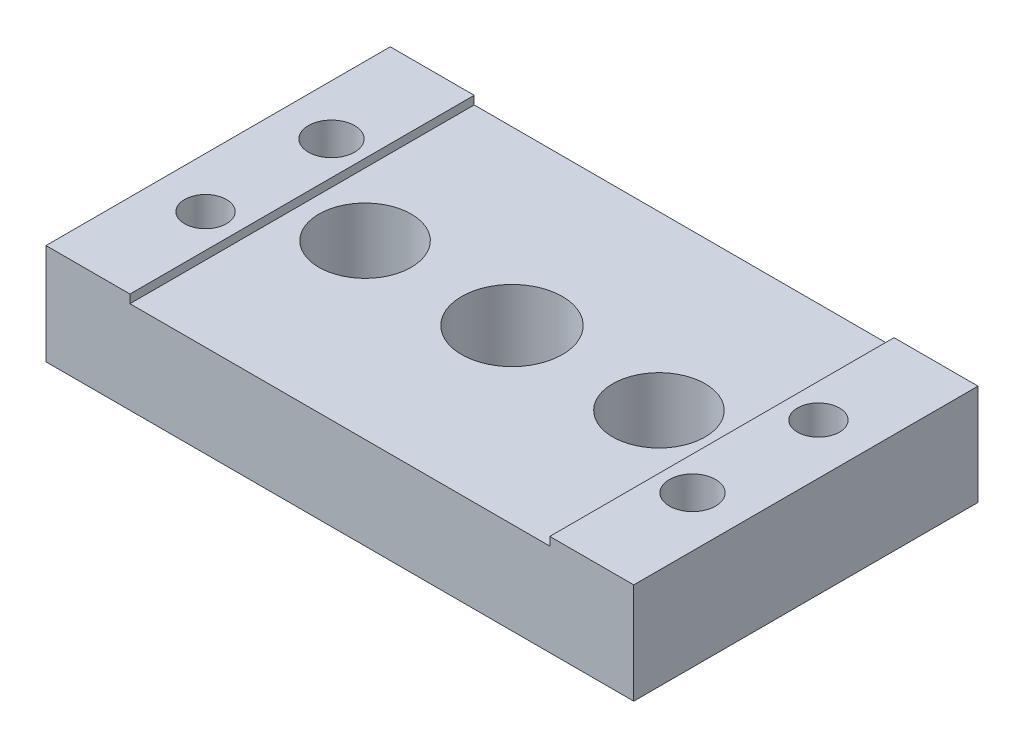
ISO-10303-21;
HEADER;
FILE_DESCRIPTION(('STEP AP214'),'2;1');
FILE_NAME('part.step','',(''),(''),'','','');
FILE_SCHEMA(('AUTOMOTIVE_DESIGN { 1 0 10303 214 1 1 1 1 }'));
ENDSEC;
DATA;
#1=APPLICATION_CONTEXT('core data for automotive mechanical design processes');
#2=APPLICATION_PROTOCOL_DEFINITION('international standard','automotive_design',2000,#1);
#3=PRODUCT_CONTEXT('',#1,'mechanical');
#4=PRODUCT('Part','Part','',(#3));
#5=PRODUCT_RELATED_PRODUCT_CATEGORY('part','',(#4));
#6=PRODUCT_DEFINITION_FORMATION('','',#4);
#7=PRODUCT_DEFINITION_CONTEXT('part definition',#1,'design');
#8=PRODUCT_DEFINITION('design','',#6,#7);
#9=PRODUCT_DEFINITION_SHAPE('','',#8);
#10=(LENGTH_UNIT() NAMED_UNIT(*) SI_UNIT(.MILLI.,.METRE.));
#11=(NAMED_UNIT(*) PLANE_ANGLE_UNIT() SI_UNIT($,.RADIAN.));
#12=(NAMED_UNIT(*) SI_UNIT($,.STERADIAN.) SOLID_ANGLE_UNIT());
#13=UNCERTAINTY_MEASURE_WITH_UNIT(LENGTH_MEASURE(1.E-05),#10,'distance_accuracy_value','');
#14=(GEOMETRIC_REPRESENTATION_CONTEXT(3) GLOBAL_UNCERTAINTY_ASSIGNED_CONTEXT((#13)) GLOBAL_UNIT_ASSIGNED_CONTEXT((#10,
#11,#12)) REPRESENTATION_CONTEXT('',''));
#15=CARTESIAN_POINT('',(0.,0.,0.));
#16=DIRECTION('',(0.,0.,1.));
#17=DIRECTION('',(1.,0.,0.));
#18=AXIS2_PLACEMENT_3D('',#15,#16,#17);
#19=CARTESIAN_POINT('',(29.,88.,7.50000000000001));
#20=DIRECTION('',(0.,-1.,0.));
#21=DIRECTION('',(0.,0.,-1.));
#22=AXIS2_PLACEMENT_3D('',#19,#20,#21);
#23=CYLINDRICAL_SURFACE('',#22,2.75);
#24=CARTESIAN_POINT('',(29.,12.,7.50000000000001));
#25=DIRECTION('',(0.,1.,0.));
#26=DIRECTION('',(0.,0.,1.));
#27=AXIS2_PLACEMENT_3D('',#24,#25,#26);
#28=CIRCLE('',#27,2.75);
#29=CARTESIAN_POINT('',(29.,12.,10.25));
#30=VERTEX_POINT('',#29);
#31=EDGE_CURVE('E207',#30,#30,#28,.T.);
#32=ORIENTED_EDGE('',*,*,#31,.T.);
#33=EDGE_LOOP('',(#32));
#34=FACE_BOUND('',#33,.T.);
#35=CARTESIAN_POINT('',(29.,5.7,7.50000000000001));
#36=DIRECTION('',(0.,-1.,0.));
#37=DIRECTION('',(0.,0.,-1.));
#38=AXIS2_PLACEMENT_3D('',#35,#36,#37);
#39=CIRCLE('',#38,2.75);
#40=CARTESIAN_POINT('',(29.,5.7,4.75));
#41=VERTEX_POINT('',#40);
#42=EDGE_CURVE('E170',#41,#41,#39,.F.);
#43=ORIENTED_EDGE('',*,*,#42,.F.);
#44=EDGE_LOOP('',(#43));
#45=FACE_BOUND('',#44,.T.);
#46=ADVANCED_FACE('F33',(#34,#45),#23,.F.);
#47=CARTESIAN_POINT('',(-29.,88.,-7.5));
#48=DIRECTION('',(0.,-1.,0.));
#49=DIRECTION('',(0.,0.,-1.));
#50=AXIS2_PLACEMENT_3D('',#47,#48,#49);
#51=CYLINDRICAL_SURFACE('',#50,2.75);
#52=CARTESIAN_POINT('',(-29.,12.,-7.5));
#53=DIRECTION('',(0.,1.,0.));
#54=DIRECTION('',(0.,0.,1.));
#55=AXIS2_PLACEMENT_3D('',#52,#53,#54);
#56=CIRCLE('',#55,2.75);
#57=CARTESIAN_POINT('',(-29.,12.,-4.75));
#58=VERTEX_POINT('',#57);
#59=EDGE_CURVE('E128',#58,#58,#56,.T.);
#60=ORIENTED_EDGE('',*,*,#59,.T.);
#61=EDGE_LOOP('',(#60));
#62=FACE_BOUND('',#61,.T.);
#63=CARTESIAN_POINT('',(-29.,5.7,-7.5));
#64=DIRECTION('',(0.,-1.,0.));
#65=DIRECTION('',(0.,0.,-1.));
#66=AXIS2_PLACEMENT_3D('',#63,#64,#65);
#67=CIRCLE('',#66,2.75);
#68=CARTESIAN_POINT('',(-29.,5.7,-10.25));
#69=VERTEX_POINT('',#68);
#70=EDGE_CURVE('E167',#69,#69,#67,.F.);
#71=ORIENTED_EDGE('',*,*,#70,.F.);
#72=EDGE_LOOP('',(#71));
#73=FACE_BOUND('',#72,.T.);
#74=ADVANCED_FACE('F212',(#62,#73),#51,.F.);
#75=CARTESIAN_POINT('',(0.,12.,0.));
#76=DIRECTION('',(0.,1.,0.));
#77=DIRECTION('',(0.,0.,1.));
#78=AXIS2_PLACEMENT_3D('',#75,#76,#77);
#79=PLANE('',#78);
#80=ORIENTED_EDGE('',*,*,#59,.F.);
#81=EDGE_LOOP('',(#80));
#82=FACE_BOUND('',#81,.T.);
#83=CARTESIAN_POINT('',(-29.,12.,7.5));
#84=DIRECTION('',(0.,1.,0.));
#85=DIRECTION('',(0.,0.,1.));
#86=AXIS2_PLACEMENT_3D('',#83,#84,#85);
#87=CIRCLE('',#86,2.5);
#88=CARTESIAN_POINT('',(-29.,12.,10.));
#89=VERTEX_POINT('',#88);
#90=EDGE_CURVE('E204',#89,#89,#87,.T.);
#91=ORIENTED_EDGE('',*,*,#90,.F.);
#92=EDGE_LOOP('',(#91));
#93=FACE_BOUND('',#92,.T.);
#94=DIRECTION('',(0.,0.,1.));
#95=VECTOR('',#94,1.);
#96=CARTESIAN_POINT('',(-25.,12.,0.));
#97=LINE('',#96,#95);
#98=CARTESIAN_POINT('',(-25.,12.,-20.5));
#99=VERTEX_POINT('',#98);
#100=CARTESIAN_POINT('',(-25.,12.,20.5));
#101=VERTEX_POINT('',#100);
#102=EDGE_CURVE('E11',#99,#101,#97,.T.);
#103=ORIENTED_EDGE('',*,*,#102,.F.);
#104=DIRECTION('',(-1.,0.,0.));
#105=VECTOR('',#104,1.);
#106=CARTESIAN_POINT('',(-35.,12.,-20.5));
#107=LINE('',#106,#105);
#108=CARTESIAN_POINT('',(-35.,12.,-20.5));
#109=VERTEX_POINT('',#108);
#110=EDGE_CURVE('E144',#99,#109,#107,.T.);
#111=ORIENTED_EDGE('',*,*,#110,.T.);
#112=DIRECTION('',(0.,0.,1.));
#113=VECTOR('',#112,1.);
#114=CARTESIAN_POINT('',(-35.,12.,-20.5));
#115=LINE('',#114,#113);
#116=CARTESIAN_POINT('',(-35.,12.,20.5));
#117=VERTEX_POINT('',#116);
#118=EDGE_CURVE('E146',#109,#117,#115,.T.);
#119=ORIENTED_EDGE('',*,*,#118,.T.);
#120=DIRECTION('',(1.,0.,0.));
#121=VECTOR('',#120,1.);
#122=CARTESIAN_POINT('',(-35.,12.,20.5));
#123=LINE('',#122,#121);
#124=EDGE_CURVE('E148',#117,#101,#123,.T.);
#125=ORIENTED_EDGE('',*,*,#124,.T.);
#126=EDGE_LOOP('',(#103,#111,#119,#125));
#127=FACE_BOUND('',#126,.T.);
#128=ADVANCED_FACE('F215',(#82,#93,#127),#79,.T.);
#129=CARTESIAN_POINT('',(35.,12.,-20.5));
#130=DIRECTION('',(-1.,0.,0.));
#131=DIRECTION('',(0.,0.,1.));
#132=AXIS2_PLACEMENT_3D('',#129,#130,#131);
#133=PLANE('',#132);
#134=DIRECTION('',(0.,0.,-1.));
#135=VECTOR('',#134,1.);
#136=CARTESIAN_POINT('',(35.,0.,-20.5));
#137=LINE('',#136,#135);
#138=CARTESIAN_POINT('',(35.,0.,20.5));
#139=VERTEX_POINT('',#138);
#140=CARTESIAN_POINT('',(35.,0.,-20.5));
#141=VERTEX_POINT('',#140);
#142=EDGE_CURVE('E141',#139,#141,#137,.T.);
#143=ORIENTED_EDGE('',*,*,#142,.T.);
#144=DIRECTION('',(0.,-1.,0.));
#145=VECTOR('',#144,1.);
#146=CARTESIAN_POINT('',(35.,12.,-20.5));
#147=LINE('',#146,#145);
#148=CARTESIAN_POINT('',(35.,12.,-20.5));
#149=VERTEX_POINT('',#148);
#150=EDGE_CURVE('E164',#149,#141,#147,.T.);
#151=ORIENTED_EDGE('',*,*,#150,.F.);
#152=DIRECTION('',(0.,0.,-1.));
#153=VECTOR('',#152,1.);
#154=CARTESIAN_POINT('',(35.,12.,-20.5));
#155=LINE('',#154,#153);
#156=CARTESIAN_POINT('',(35.,12.,20.5));
#157=VERTEX_POINT('',#156);
#158=EDGE_CURVE('E142',#157,#149,#155,.T.);
#159=ORIENTED_EDGE('',*,*,#158,.F.);
#160=DIRECTION('',(0.,-1.,0.));
#161=VECTOR('',#160,1.);
#162=CARTESIAN_POINT('',(35.,12.,20.5));
#163=LINE('',#162,#161);
#164=EDGE_CURVE('E150',#157,#139,#163,.T.);
#165=ORIENTED_EDGE('',*,*,#164,.T.);
#166=EDGE_LOOP('',(#143,#151,#159,#165));
#167=FACE_BOUND('',#166,.T.);
#168=ADVANCED_FACE('F35',(#167),#133,.F.);
#169=CARTESIAN_POINT('',(-35.,12.,-20.5));
#170=DIRECTION('',(0.,0.,1.));
#171=DIRECTION('',(1.,0.,0.));
#172=AXIS2_PLACEMENT_3D('',#169,#170,#171);
#173=PLANE('',#172);
#174=CARTESIAN_POINT('',(6.50000000000001,5.5,-20.5));
#175=DIRECTION('',(0.,0.,-1.));
#176=DIRECTION('',(-1.,0.,0.));
#177=AXIS2_PLACEMENT_3D('',#174,#175,#176);
#178=CIRCLE('',#177,2.5);
#179=CARTESIAN_POINT('',(4.00000000000001,5.5,-20.5));
#180=VERTEX_POINT('',#179);
#181=EDGE_CURVE('E302',#180,#180,#178,.T.);
#182=ORIENTED_EDGE('',*,*,#181,.F.);
#183=EDGE_LOOP('',(#182));
#184=FACE_BOUND('',#183,.T.);
#185=ORIENTED_EDGE('',*,*,#110,.F.);
#186=DIRECTION('',(0.,-1.,0.));
#187=VECTOR('',#186,1.);
#188=CARTESIAN_POINT('',(-25.,12.,-20.5));
#189=LINE('',#188,#187);
#190=CARTESIAN_POINT('',(-25.,11.,-20.5));
#191=VERTEX_POINT('',#190);
#192=EDGE_CURVE('E138',#99,#191,#189,.T.);
#193=ORIENTED_EDGE('',*,*,#192,.T.);
#194=DIRECTION('',(1.,0.,0.));
#195=VECTOR('',#194,1.);
#196=CARTESIAN_POINT('',(-35.,11.,-20.5));
#197=LINE('',#196,#195);
#198=CARTESIAN_POINT('',(25.,11.,-20.5));
#199=VERTEX_POINT('',#198);
#200=EDGE_CURVE('E117',#191,#199,#197,.T.);
#201=ORIENTED_EDGE('',*,*,#200,.T.);
#202=DIRECTION('',(0.,1.,0.));
#203=VECTOR('',#202,1.);
#204=CARTESIAN_POINT('',(25.,12.,-20.5));
#205=LINE('',#204,#203);
#206=CARTESIAN_POINT('',(25.,12.,-20.5));
#207=VERTEX_POINT('',#206);
#208=EDGE_CURVE('E135',#199,#207,#205,.T.);
#209=ORIENTED_EDGE('',*,*,#208,.T.);
#210=EDGE_CURVE('E88',#149,#207,#107,.T.);
#211=ORIENTED_EDGE('',*,*,#210,.F.);
#212=ORIENTED_EDGE('',*,*,#150,.T.);
#213=DIRECTION('',(-1.,0.,0.));
#214=VECTOR('',#213,1.);
#215=CARTESIAN_POINT('',(-35.,0.,-20.5));
#216=LINE('',#215,#214);
#217=CARTESIAN_POINT('',(-35.,0.,-20.5));
#218=VERTEX_POINT('',#217);
#219=EDGE_CURVE('E153',#141,#218,#216,.T.);
#220=ORIENTED_EDGE('',*,*,#219,.T.);
#221=DIRECTION('',(0.,-1.,0.));
#222=VECTOR('',#221,1.);
#223=CARTESIAN_POINT('',(-35.,12.,-20.5));
#224=LINE('',#223,#222);
#225=EDGE_CURVE('E161',#109,#218,#224,.T.);
#226=ORIENTED_EDGE('',*,*,#225,.F.);
#227=EDGE_LOOP('',(#185,#193,#201,#209,#211,#212,#220,#226));
#228=FACE_BOUND('',#227,.T.);
#229=ADVANCED_FACE('F224',(#184,#228),#173,.F.);
#230=CARTESIAN_POINT('',(-35.,12.,-20.5));
#231=DIRECTION('',(1.,0.,0.));
#232=DIRECTION('',(0.,0.,-1.));
#233=AXIS2_PLACEMENT_3D('',#230,#231,#232);
#234=PLANE('',#233);
#235=DIRECTION('',(0.,0.,1.));
#236=VECTOR('',#235,1.);
#237=CARTESIAN_POINT('',(-35.,0.,-20.5));
#238=LINE('',#237,#236);
#239=CARTESIAN_POINT('',(-35.,0.,20.5));
#240=VERTEX_POINT('',#239);
#241=EDGE_CURVE('E155',#218,#240,#238,.T.);
#242=ORIENTED_EDGE('',*,*,#241,.T.);
#243=DIRECTION('',(0.,-1.,0.));
#244=VECTOR('',#243,1.);
#245=CARTESIAN_POINT('',(-35.,12.,20.5));
#246=LINE('',#245,#244);
#247=EDGE_CURVE('E159',#117,#240,#246,.T.);
#248=ORIENTED_EDGE('',*,*,#247,.F.);
#249=ORIENTED_EDGE('',*,*,#118,.F.);
#250=ORIENTED_EDGE('',*,*,#225,.T.);
#251=EDGE_LOOP('',(#242,#248,#249,#250));
#252=FACE_BOUND('',#251,.T.);
#253=ADVANCED_FACE('F229',(#252),#234,.F.);
#254=CARTESIAN_POINT('',(-35.,12.,20.5));
#255=DIRECTION('',(0.,0.,-1.));
#256=DIRECTION('',(-1.,0.,0.));
#257=AXIS2_PLACEMENT_3D('',#254,#255,#256);
#258=PLANE('',#257);
#259=DIRECTION('',(1.,0.,0.));
#260=VECTOR('',#259,1.);
#261=CARTESIAN_POINT('',(-25.,11.,20.5));
#262=LINE('',#261,#260);
#263=CARTESIAN_POINT('',(-25.,11.,20.5));
#264=VERTEX_POINT('',#263);
#265=CARTESIAN_POINT('',(25.,11.,20.5));
#266=VERTEX_POINT('',#265);
#267=EDGE_CURVE('E115',#264,#266,#262,.T.);
#268=ORIENTED_EDGE('',*,*,#267,.F.);
#269=DIRECTION('',(0.,-1.,0.));
#270=VECTOR('',#269,1.);
#271=CARTESIAN_POINT('',(-25.,12.,20.5));
#272=LINE('',#271,#270);
#273=EDGE_CURVE('E123',#101,#264,#272,.T.);
#274=ORIENTED_EDGE('',*,*,#273,.F.);
#275=ORIENTED_EDGE('',*,*,#124,.F.);
#276=ORIENTED_EDGE('',*,*,#247,.T.);
#277=DIRECTION('',(1.,0.,0.));
#278=VECTOR('',#277,1.);
#279=CARTESIAN_POINT('',(-35.,0.,20.5));
#280=LINE('',#279,#278);
#281=EDGE_CURVE('E80',#240,#139,#280,.T.);
#282=ORIENTED_EDGE('',*,*,#281,.T.);
#283=ORIENTED_EDGE('',*,*,#164,.F.);
#284=CARTESIAN_POINT('',(25.,12.,20.5));
#285=VERTEX_POINT('',#284);
#286=EDGE_CURVE('E58',#285,#157,#123,.T.);
#287=ORIENTED_EDGE('',*,*,#286,.F.);
#288=DIRECTION('',(0.,1.,0.));
#289=VECTOR('',#288,1.);
#290=CARTESIAN_POINT('',(25.,12.,20.5));
#291=LINE('',#290,#289);
#292=EDGE_CURVE('E50',#266,#285,#291,.T.);
#293=ORIENTED_EDGE('',*,*,#292,.F.);
#294=EDGE_LOOP('',(#268,#274,#275,#276,#282,#283,#287,#293));
#295=FACE_BOUND('',#294,.T.);
#296=ADVANCED_FACE('F130',(#295),#258,.F.);
#297=ORIENTED_EDGE('',*,*,#31,.F.);
#298=EDGE_LOOP('',(#297));
#299=FACE_BOUND('',#298,.T.);
#300=CARTESIAN_POINT('',(29.,12.,-7.5));
#301=DIRECTION('',(0.,1.,0.));
#302=DIRECTION('',(0.,0.,1.));
#303=AXIS2_PLACEMENT_3D('',#300,#301,#302);
#304=CIRCLE('',#303,2.5);
#305=CARTESIAN_POINT('',(29.,12.,-4.99999999999999));
#306=VERTEX_POINT('',#305);
#307=EDGE_CURVE('E201',#306,#306,#304,.T.);
#308=ORIENTED_EDGE('',*,*,#307,.F.);
#309=EDGE_LOOP('',(#308));
#310=FACE_BOUND('',#309,.T.);
#311=DIRECTION('',(0.,0.,-1.));
#312=VECTOR('',#311,1.);
#313=CARTESIAN_POINT('',(25.,12.,0.));
#314=LINE('',#313,#312);
#315=EDGE_CURVE('E42',#285,#207,#314,.T.);
#316=ORIENTED_EDGE('',*,*,#315,.F.);
#317=ORIENTED_EDGE('',*,*,#286,.T.);
#318=ORIENTED_EDGE('',*,*,#158,.T.);
#319=ORIENTED_EDGE('',*,*,#210,.T.);
#320=EDGE_LOOP('',(#316,#317,#318,#319));
#321=FACE_BOUND('',#320,.T.);
#322=ADVANCED_FACE('F219',(#299,#310,#321),#79,.T.);
#323=CARTESIAN_POINT('',(0.,0.,0.));
#324=DIRECTION('',(0.,1.,0.));
#325=DIRECTION('',(0.,0.,1.));
#326=AXIS2_PLACEMENT_3D('',#323,#324,#325);
#327=PLANE('',#326);
#328=CARTESIAN_POINT('',(17.5,0.,0.));
#329=DIRECTION('',(0.,-1.,0.));
#330=DIRECTION('',(0.,0.,-1.));
#331=AXIS2_PLACEMENT_3D('',#328,#329,#330);
#332=CIRCLE('',#331,5.5);
#333=CARTESIAN_POINT('',(17.5,0.,-5.5));
#334=VERTEX_POINT('',#333);
#335=EDGE_CURVE('E301',#334,#334,#332,.T.);
#336=ORIENTED_EDGE('',*,*,#335,.F.);
#337=EDGE_LOOP('',(#336));
#338=FACE_BOUND('',#337,.T.);
#339=CARTESIAN_POINT('',(-17.5,0.,0.));
#340=DIRECTION('',(0.,-1.,0.));
#341=DIRECTION('',(0.,0.,-1.));
#342=AXIS2_PLACEMENT_3D('',#339,#340,#341);
#343=CIRCLE('',#342,5.5);
#344=CARTESIAN_POINT('',(-17.5,0.,-5.5));
#345=VERTEX_POINT('',#344);
#346=EDGE_CURVE('E305',#345,#345,#343,.T.);
#347=ORIENTED_EDGE('',*,*,#346,.F.);
#348=EDGE_LOOP('',(#347));
#349=FACE_BOUND('',#348,.T.);
#350=CARTESIAN_POINT('',(0.,0.,0.));
#351=DIRECTION('',(0.,-1.,0.));
#352=DIRECTION('',(0.,0.,-1.));
#353=AXIS2_PLACEMENT_3D('',#350,#351,#352);
#354=CIRCLE('',#353,6.);
#355=CARTESIAN_POINT('',(0.,0.,-6.));
#356=VERTEX_POINT('',#355);
#357=EDGE_CURVE('E178',#356,#356,#354,.T.);
#358=ORIENTED_EDGE('',*,*,#357,.F.);
#359=EDGE_LOOP('',(#358));
#360=FACE_BOUND('',#359,.T.);
#361=CARTESIAN_POINT('',(-29.,0.,-7.5));
#362=DIRECTION('',(0.,-1.,0.));
#363=DIRECTION('',(0.,0.,-1.));
#364=AXIS2_PLACEMENT_3D('',#361,#362,#363);
#365=CIRCLE('',#364,5.);
#366=CARTESIAN_POINT('',(-29.,0.,-12.5));
#367=VERTEX_POINT('',#366);
#368=EDGE_CURVE('E192',#367,#367,#365,.T.);
#369=ORIENTED_EDGE('',*,*,#368,.F.);
#370=EDGE_LOOP('',(#369));
#371=FACE_BOUND('',#370,.T.);
#372=CARTESIAN_POINT('',(29.,0.,7.50000000000001));
#373=DIRECTION('',(0.,-1.,0.));
#374=DIRECTION('',(0.,0.,-1.));
#375=AXIS2_PLACEMENT_3D('',#372,#373,#374);
#376=CIRCLE('',#375,5.);
#377=CARTESIAN_POINT('',(29.,0.,2.50000000000001));
#378=VERTEX_POINT('',#377);
#379=EDGE_CURVE('E183',#378,#378,#376,.T.);
#380=ORIENTED_EDGE('',*,*,#379,.F.);
#381=EDGE_LOOP('',(#380));
#382=FACE_BOUND('',#381,.T.);
#383=CARTESIAN_POINT('',(-29.,0.,7.5));
#384=DIRECTION('',(0.,-1.,0.));
#385=DIRECTION('',(0.,0.,-1.));
#386=AXIS2_PLACEMENT_3D('',#383,#384,#385);
#387=CIRCLE('',#386,2.5);
#388=CARTESIAN_POINT('',(-29.,0.,5.));
#389=VERTEX_POINT('',#388);
#390=EDGE_CURVE('E174',#389,#389,#387,.T.);
#391=ORIENTED_EDGE('',*,*,#390,.F.);
#392=EDGE_LOOP('',(#391));
#393=FACE_BOUND('',#392,.T.);
#394=CARTESIAN_POINT('',(29.,0.,-7.5));
#395=DIRECTION('',(0.,-1.,0.));
#396=DIRECTION('',(0.,0.,-1.));
#397=AXIS2_PLACEMENT_3D('',#394,#395,#396);
#398=CIRCLE('',#397,2.5);
#399=CARTESIAN_POINT('',(29.,0.,-10.));
#400=VERTEX_POINT('',#399);
#401=EDGE_CURVE('E198',#400,#400,#398,.T.);
#402=ORIENTED_EDGE('',*,*,#401,.F.);
#403=EDGE_LOOP('',(#402));
#404=FACE_BOUND('',#403,.T.);
#405=ORIENTED_EDGE('',*,*,#142,.F.);
#406=ORIENTED_EDGE('',*,*,#281,.F.);
#407=ORIENTED_EDGE('',*,*,#241,.F.);
#408=ORIENTED_EDGE('',*,*,#219,.F.);
#409=EDGE_LOOP('',(#405,#406,#407,#408));
#410=FACE_BOUND('',#409,.T.);
#411=ADVANCED_FACE('F232',(#338,#349,#360,#371,#382,#393,#404,#410),#327,.F.);
#412=CARTESIAN_POINT('',(-25.,11.,-67.5));
#413=DIRECTION('',(0.,-1.,0.));
#414=DIRECTION('',(0.,0.,-1.));
#415=AXIS2_PLACEMENT_3D('',#412,#413,#414);
#416=PLANE('',#415);
#417=CARTESIAN_POINT('',(17.5,11.,0.));
#418=DIRECTION('',(0.,-1.,0.));
#419=DIRECTION('',(0.,0.,-1.));
#420=AXIS2_PLACEMENT_3D('',#417,#418,#419);
#421=CIRCLE('',#420,5.5);
#422=CARTESIAN_POINT('',(17.5,11.,-5.5));
#423=VERTEX_POINT('',#422);
#424=EDGE_CURVE('E37',#423,#423,#421,.T.);
#425=ORIENTED_EDGE('',*,*,#424,.T.);
#426=EDGE_LOOP('',(#425));
#427=FACE_BOUND('',#426,.T.);
#428=CARTESIAN_POINT('',(-17.5,11.,0.));
#429=DIRECTION('',(0.,-1.,0.));
#430=DIRECTION('',(0.,0.,-1.));
#431=AXIS2_PLACEMENT_3D('',#428,#429,#430);
#432=CIRCLE('',#431,5.5);
#433=CARTESIAN_POINT('',(-17.5,11.,-5.5));
#434=VERTEX_POINT('',#433);
#435=EDGE_CURVE('E177',#434,#434,#432,.T.);
#436=ORIENTED_EDGE('',*,*,#435,.T.);
#437=EDGE_LOOP('',(#436));
#438=FACE_BOUND('',#437,.T.);
#439=CARTESIAN_POINT('',(0.,11.,0.));
#440=DIRECTION('',(0.,-1.,0.));
#441=DIRECTION('',(0.,0.,-1.));
#442=AXIS2_PLACEMENT_3D('',#439,#440,#441);
#443=CIRCLE('',#442,6.);
#444=CARTESIAN_POINT('',(0.,11.,-6.));
#445=VERTEX_POINT('',#444);
#446=EDGE_CURVE('E175',#445,#445,#443,.T.);
#447=ORIENTED_EDGE('',*,*,#446,.T.);
#448=EDGE_LOOP('',(#447));
#449=FACE_BOUND('',#448,.T.);
#450=DIRECTION('',(0.,0.,1.));
#451=VECTOR('',#450,1.);
#452=CARTESIAN_POINT('',(-25.,11.,-67.5));
#453=LINE('',#452,#451);
#454=EDGE_CURVE('E110',#191,#264,#453,.T.);
#455=ORIENTED_EDGE('',*,*,#454,.T.);
#456=ORIENTED_EDGE('',*,*,#267,.T.);
#457=DIRECTION('',(0.,0.,1.));
#458=VECTOR('',#457,1.);
#459=CARTESIAN_POINT('',(25.,11.,-67.5));
#460=LINE('',#459,#458);
#461=EDGE_CURVE('E120',#199,#266,#460,.T.);
#462=ORIENTED_EDGE('',*,*,#461,.F.);
#463=ORIENTED_EDGE('',*,*,#200,.F.);
#464=EDGE_LOOP('',(#455,#456,#462,#463));
#465=FACE_BOUND('',#464,.T.);
#466=ADVANCED_FACE('F112',(#427,#438,#449,#465),#416,.F.);
#467=CARTESIAN_POINT('',(-25.,12.,-67.5));
#468=DIRECTION('',(-1.,0.,0.));
#469=DIRECTION('',(0.,0.,1.));
#470=AXIS2_PLACEMENT_3D('',#467,#468,#469);
#471=PLANE('',#470);
#472=ORIENTED_EDGE('',*,*,#102,.T.);
#473=ORIENTED_EDGE('',*,*,#273,.T.);
#474=ORIENTED_EDGE('',*,*,#454,.F.);
#475=ORIENTED_EDGE('',*,*,#192,.F.);
#476=EDGE_LOOP('',(#472,#473,#474,#475));
#477=FACE_BOUND('',#476,.T.);
#478=ADVANCED_FACE('F124',(#477),#471,.F.);
#479=CARTESIAN_POINT('',(25.,12.,-67.5));
#480=DIRECTION('',(1.,0.,0.));
#481=DIRECTION('',(0.,0.,-1.));
#482=AXIS2_PLACEMENT_3D('',#479,#480,#481);
#483=PLANE('',#482);
#484=ORIENTED_EDGE('',*,*,#461,.T.);
#485=ORIENTED_EDGE('',*,*,#292,.T.);
#486=ORIENTED_EDGE('',*,*,#315,.T.);
#487=ORIENTED_EDGE('',*,*,#208,.F.);
#488=EDGE_LOOP('',(#484,#485,#486,#487));
#489=FACE_BOUND('',#488,.T.);
#490=ADVANCED_FACE('F236',(#489),#483,.F.);
#491=CARTESIAN_POINT('',(29.,88.,-7.5));
#492=DIRECTION('',(0.,-1.,0.));
#493=DIRECTION('',(0.,0.,-1.));
#494=AXIS2_PLACEMENT_3D('',#491,#492,#493);
#495=CYLINDRICAL_SURFACE('',#494,2.5);
#496=ORIENTED_EDGE('',*,*,#307,.T.);
#497=EDGE_LOOP('',(#496));
#498=FACE_BOUND('',#497,.T.);
#499=ORIENTED_EDGE('',*,*,#401,.T.);
#500=EDGE_LOOP('',(#499));
#501=FACE_BOUND('',#500,.T.);
#502=ADVANCED_FACE('F238',(#498,#501),#495,.F.);
#503=CARTESIAN_POINT('',(-29.,88.,7.5));
#504=DIRECTION('',(0.,-1.,0.));
#505=DIRECTION('',(0.,0.,-1.));
#506=AXIS2_PLACEMENT_3D('',#503,#504,#505);
#507=CYLINDRICAL_SURFACE('',#506,2.5);
#508=ORIENTED_EDGE('',*,*,#90,.T.);
#509=EDGE_LOOP('',(#508));
#510=FACE_BOUND('',#509,.T.);
#511=ORIENTED_EDGE('',*,*,#390,.T.);
#512=EDGE_LOOP('',(#511));
#513=FACE_BOUND('',#512,.T.);
#514=ADVANCED_FACE('F245',(#510,#513),#507,.F.);
#515=CARTESIAN_POINT('',(-29.,5.7,-7.5));
#516=DIRECTION('',(0.,-1.,0.));
#517=DIRECTION('',(0.,0.,-1.));
#518=AXIS2_PLACEMENT_3D('',#515,#516,#517);
#519=PLANE('',#518);
#520=CARTESIAN_POINT('',(-29.,5.7,-7.5));
#521=DIRECTION('',(0.,-1.,0.));
#522=DIRECTION('',(0.,0.,-1.));
#523=AXIS2_PLACEMENT_3D('',#520,#521,#522);
#524=CIRCLE('',#523,5.);
#525=CARTESIAN_POINT('',(-29.,5.7,-12.5));
#526=VERTEX_POINT('',#525);
#527=EDGE_CURVE('E171',#526,#526,#524,.T.);
#528=ORIENTED_EDGE('',*,*,#527,.T.);
#529=EDGE_LOOP('',(#528));
#530=FACE_BOUND('',#529,.T.);
#531=ORIENTED_EDGE('',*,*,#70,.T.);
#532=EDGE_LOOP('',(#531));
#533=FACE_BOUND('',#532,.T.);
#534=ADVANCED_FACE('F260',(#530,#533),#519,.T.);
#535=CARTESIAN_POINT('',(-29.,5.7,-7.5));
#536=DIRECTION('',(0.,-1.,0.));
#537=DIRECTION('',(0.,0.,-1.));
#538=AXIS2_PLACEMENT_3D('',#535,#536,#537);
#539=CYLINDRICAL_SURFACE('',#538,5.);
#540=ORIENTED_EDGE('',*,*,#527,.F.);
#541=EDGE_LOOP('',(#540));
#542=FACE_BOUND('',#541,.T.);
#543=ORIENTED_EDGE('',*,*,#368,.T.);
#544=EDGE_LOOP('',(#543));
#545=FACE_BOUND('',#544,.T.);
#546=ADVANCED_FACE('F270',(#542,#545),#539,.F.);
#547=CARTESIAN_POINT('',(29.,5.7,7.50000000000001));
#548=DIRECTION('',(0.,-1.,0.));
#549=DIRECTION('',(0.,0.,-1.));
#550=AXIS2_PLACEMENT_3D('',#547,#548,#549);
#551=PLANE('',#550);
#552=CARTESIAN_POINT('',(29.,5.7,7.50000000000001));
#553=DIRECTION('',(0.,-1.,0.));
#554=DIRECTION('',(0.,0.,-1.));
#555=AXIS2_PLACEMENT_3D('',#552,#553,#554);
#556=CIRCLE('',#555,5.);
#557=CARTESIAN_POINT('',(29.,5.7,2.50000000000001));
#558=VERTEX_POINT('',#557);
#559=EDGE_CURVE('E187',#558,#558,#556,.T.);
#560=ORIENTED_EDGE('',*,*,#559,.T.);
#561=EDGE_LOOP('',(#560));
#562=FACE_BOUND('',#561,.T.);
#563=ORIENTED_EDGE('',*,*,#42,.T.);
#564=EDGE_LOOP('',(#563));
#565=FACE_BOUND('',#564,.T.);
#566=ADVANCED_FACE('F266',(#562,#565),#551,.T.);
#567=CARTESIAN_POINT('',(29.,5.7,7.50000000000001));
#568=DIRECTION('',(0.,-1.,0.));
#569=DIRECTION('',(0.,0.,-1.));
#570=AXIS2_PLACEMENT_3D('',#567,#568,#569);
#571=CYLINDRICAL_SURFACE('',#570,5.);
#572=ORIENTED_EDGE('',*,*,#559,.F.);
#573=EDGE_LOOP('',(#572));
#574=FACE_BOUND('',#573,.T.);
#575=ORIENTED_EDGE('',*,*,#379,.T.);
#576=EDGE_LOOP('',(#575));
#577=FACE_BOUND('',#576,.T.);
#578=ADVANCED_FACE('F262',(#574,#577),#571,.F.);
#579=CARTESIAN_POINT('',(0.,39.,0.));
#580=DIRECTION('',(0.,-1.,0.));
#581=DIRECTION('',(0.,0.,-1.));
#582=AXIS2_PLACEMENT_3D('',#579,#580,#581);
#583=CYLINDRICAL_SURFACE('',#582,6.);
#584=ORIENTED_EDGE('',*,*,#357,.T.);
#585=EDGE_LOOP('',(#584));
#586=FACE_BOUND('',#585,.T.);
#587=ORIENTED_EDGE('',*,*,#446,.F.);
#588=EDGE_LOOP('',(#587));
#589=FACE_BOUND('',#588,.T.);
#590=ADVANCED_FACE('F265',(#586,#589),#583,.F.);
#591=CARTESIAN_POINT('',(-17.5,39.,0.));
#592=DIRECTION('',(0.,-1.,0.));
#593=DIRECTION('',(0.,0.,-1.));
#594=AXIS2_PLACEMENT_3D('',#591,#592,#593);
#595=CYLINDRICAL_SURFACE('',#594,5.5);
#596=ORIENTED_EDGE('',*,*,#346,.T.);
#597=EDGE_LOOP('',(#596));
#598=FACE_BOUND('',#597,.T.);
#599=ORIENTED_EDGE('',*,*,#435,.F.);
#600=EDGE_LOOP('',(#599));
#601=FACE_BOUND('',#600,.T.);
#602=ADVANCED_FACE('F280',(#598,#601),#595,.F.);
#603=CARTESIAN_POINT('',(17.5,39.,0.));
#604=DIRECTION('',(0.,-1.,0.));
#605=DIRECTION('',(0.,0.,-1.));
#606=AXIS2_PLACEMENT_3D('',#603,#604,#605);
#607=CYLINDRICAL_SURFACE('',#606,5.5);
#608=ORIENTED_EDGE('',*,*,#335,.T.);
#609=EDGE_LOOP('',(#608));
#610=FACE_BOUND('',#609,.T.);
#611=ORIENTED_EDGE('',*,*,#424,.F.);
#612=EDGE_LOOP('',(#611));
#613=FACE_BOUND('',#612,.T.);
#614=ADVANCED_FACE('F282',(#610,#613),#607,.F.);
#615=CARTESIAN_POINT('',(6.50000000000001,5.5,-8.5));
#616=DIRECTION('',(0.,0.,-1.));
#617=DIRECTION('',(-1.,0.,0.));
#618=AXIS2_PLACEMENT_3D('',#615,#616,#617);
#619=CYLINDRICAL_SURFACE('',#618,2.5);
#620=CARTESIAN_POINT('',(6.50000000000001,5.5,-8.5));
#621=DIRECTION('',(0.,0.,-1.));
#622=DIRECTION('',(-1.,0.,0.));
#623=AXIS2_PLACEMENT_3D('',#620,#621,#622);
#624=CIRCLE('',#623,2.5);
#625=CARTESIAN_POINT('',(4.00000000000001,5.5,-8.5));
#626=VERTEX_POINT('',#625);
#627=EDGE_CURVE('E300',#626,#626,#624,.T.);
#628=ORIENTED_EDGE('',*,*,#627,.F.);
#629=EDGE_LOOP('',(#628));
#630=FACE_BOUND('',#629,.T.);
#631=ORIENTED_EDGE('',*,*,#181,.T.);
#632=EDGE_LOOP('',(#631));
#633=FACE_BOUND('',#632,.T.);
#634=ADVANCED_FACE('F285',(#630,#633),#619,.F.);
#635=CARTESIAN_POINT('',(6.50000000000001,5.5,-8.5));
#636=DIRECTION('',(0.,0.,-1.));
#637=DIRECTION('',(-1.,0.,0.));
#638=AXIS2_PLACEMENT_3D('',#635,#636,#637);
#639=PLANE('',#638);
#640=ORIENTED_EDGE('',*,*,#627,.T.);
#641=EDGE_LOOP('',(#640));
#642=FACE_BOUND('',#641,.T.);
#643=ADVANCED_FACE('F292',(#642),#639,.T.);
#644=CLOSED_SHELL('',(#46,#74,#128,#168,#229,#253,#296,#322,#411,#466,#478,#490,#502,#514,#534,
#546,#566,#578,#590,#602,#614,#634,#643));
#645=MANIFOLD_SOLID_BREP('B2',#644);
#646=ADVANCED_BREP_SHAPE_REPRESENTATION('',(#18,#645),#14);
#647=SHAPE_DEFINITION_REPRESENTATION(#9,#646);
ENDSEC;
END-ISO-10303-21;
